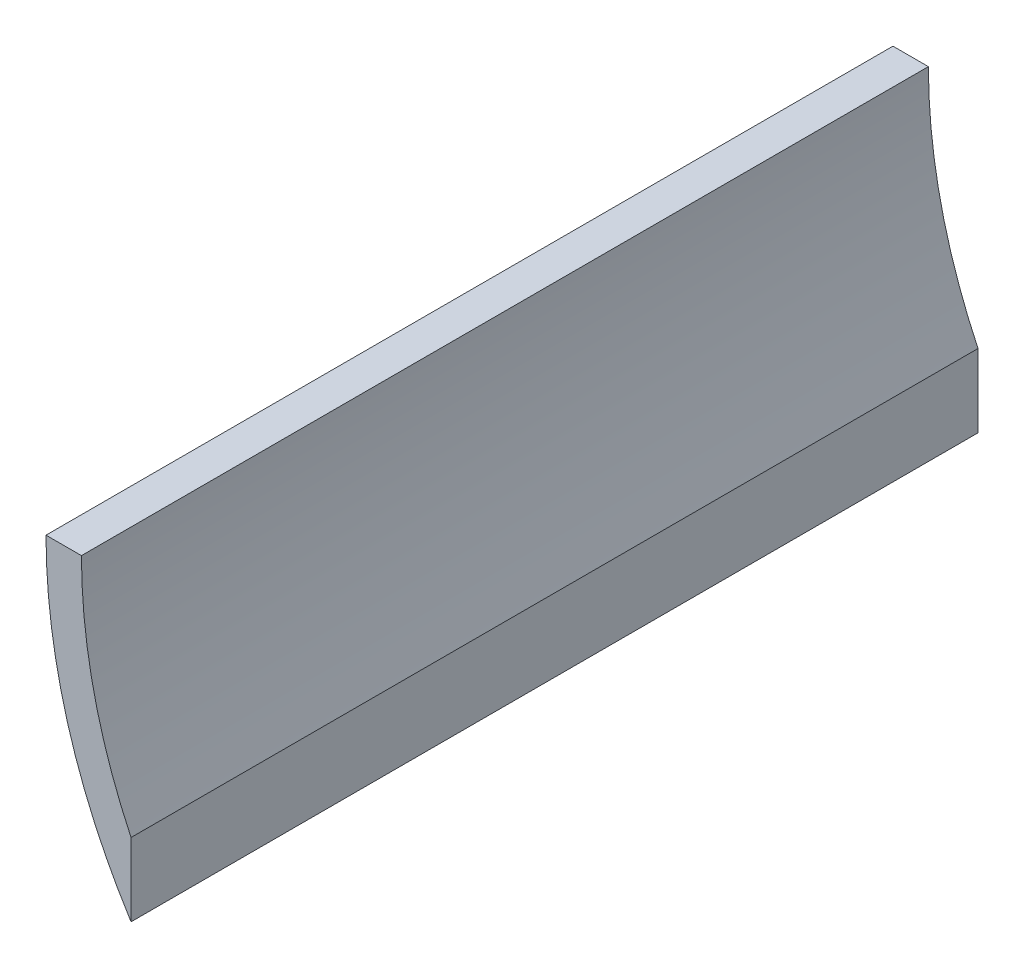
ISO-10303-21;
HEADER;
FILE_DESCRIPTION(('STEP AP214'),'2;1');
FILE_NAME('part.step','',(''),(''),'','','');
FILE_SCHEMA(('AUTOMOTIVE_DESIGN { 1 0 10303 214 1 1 1 1 }'));
ENDSEC;
DATA;
#1=APPLICATION_CONTEXT('core data for automotive mechanical design processes');
#2=APPLICATION_PROTOCOL_DEFINITION('international standard','automotive_design',2000,#1);
#3=PRODUCT_CONTEXT('',#1,'mechanical');
#4=PRODUCT('Part','Part','',(#3));
#5=PRODUCT_RELATED_PRODUCT_CATEGORY('part','',(#4));
#6=PRODUCT_DEFINITION_FORMATION('','',#4);
#7=PRODUCT_DEFINITION_CONTEXT('part definition',#1,'design');
#8=PRODUCT_DEFINITION('design','',#6,#7);
#9=PRODUCT_DEFINITION_SHAPE('','',#8);
#10=(LENGTH_UNIT() NAMED_UNIT(*) SI_UNIT(.MILLI.,.METRE.));
#11=(NAMED_UNIT(*) PLANE_ANGLE_UNIT() SI_UNIT($,.RADIAN.));
#12=(NAMED_UNIT(*) SI_UNIT($,.STERADIAN.) SOLID_ANGLE_UNIT());
#13=UNCERTAINTY_MEASURE_WITH_UNIT(LENGTH_MEASURE(1.E-05),#10,'distance_accuracy_value','');
#14=(GEOMETRIC_REPRESENTATION_CONTEXT(3) GLOBAL_UNCERTAINTY_ASSIGNED_CONTEXT((#13)) GLOBAL_UNIT_ASSIGNED_CONTEXT((#10,
#11,#12)) REPRESENTATION_CONTEXT('',''));
#15=CARTESIAN_POINT('',(0.,0.,0.));
#16=DIRECTION('',(0.,0.,1.));
#17=DIRECTION('',(1.,0.,0.));
#18=AXIS2_PLACEMENT_3D('',#15,#16,#17);
#19=CARTESIAN_POINT('',(47.7968749996477,14.7134363822845,324.920020949849));
#20=DIRECTION('',(0.,0.,-1.));
#21=DIRECTION('',(-1.,0.,0.));
#22=AXIS2_PLACEMENT_3D('',#19,#20,#21);
#23=CYLINDRICAL_SURFACE('',#22,153.796875000062);
#24=CARTESIAN_POINT('',(47.7968749996477,14.7134363822845,238.999999999999));
#25=DIRECTION('',(0.,0.,1.));
#26=DIRECTION('',(1.,0.,0.));
#27=AXIS2_PLACEMENT_3D('',#24,#25,#26);
#28=CIRCLE('',#27,153.796875000062);
#29=CARTESIAN_POINT('',(-106.000000000415,14.7134363822681,238.999999999999));
#30=VERTEX_POINT('',#29);
#31=CARTESIAN_POINT('',(-82.0000000004157,-67.7865636177321,238.999999999999));
#32=VERTEX_POINT('',#31);
#33=EDGE_CURVE('E11',#30,#32,#28,.T.);
#34=ORIENTED_EDGE('',*,*,#33,.F.);
#35=DIRECTION('',(0.,0.,-1.));
#36=VECTOR('',#35,1.);
#37=CARTESIAN_POINT('',(-106.000000000415,14.7134363822681,324.920020949849));
#38=LINE('',#37,#36);
#39=CARTESIAN_POINT('',(-106.000000000415,14.7134363822681,0.));
#40=VERTEX_POINT('',#39);
#41=EDGE_CURVE('E92',#30,#40,#38,.T.);
#42=ORIENTED_EDGE('',*,*,#41,.T.);
#43=CARTESIAN_POINT('',(47.7968749996477,14.7134363822845,0.));
#44=DIRECTION('',(0.,0.,1.));
#45=DIRECTION('',(1.,0.,0.));
#46=AXIS2_PLACEMENT_3D('',#43,#44,#45);
#47=CIRCLE('',#46,153.796875000062);
#48=CARTESIAN_POINT('',(-82.0000000004157,-67.7865636177321,0.));
#49=VERTEX_POINT('',#48);
#50=EDGE_CURVE('E83',#40,#49,#47,.T.);
#51=ORIENTED_EDGE('',*,*,#50,.T.);
#52=DIRECTION('',(0.,0.,-1.));
#53=VECTOR('',#52,1.);
#54=CARTESIAN_POINT('',(-82.0000000004157,-67.7865636177321,324.920020949849));
#55=LINE('',#54,#53);
#56=EDGE_CURVE('E75',#32,#49,#55,.T.);
#57=ORIENTED_EDGE('',*,*,#56,.F.);
#58=EDGE_LOOP('',(#34,#42,#51,#57));
#59=FACE_BOUND('',#58,.T.);
#60=ADVANCED_FACE('F36',(#59),#23,.T.);
#61=CARTESIAN_POINT('',(-81.9999999999974,-47.1760821172973,324.920020949849));
#62=DIRECTION('',(-1.,2.02970530149882E-11,0.));
#63=DIRECTION('',(-2.02970530149882E-11,-1.,0.));
#64=AXIS2_PLACEMENT_3D('',#61,#62,#63);
#65=PLANE('',#64);
#66=DIRECTION('',(2.02970530149882E-11,1.,0.));
#67=VECTOR('',#66,1.);
#68=CARTESIAN_POINT('',(-81.9999999999974,-47.1760821172973,238.999999999999));
#69=LINE('',#68,#67);
#70=CARTESIAN_POINT('',(-82.0000000004151,-47.1760821159443,238.999999999999));
#71=VERTEX_POINT('',#70);
#72=EDGE_CURVE('E54',#32,#71,#69,.T.);
#73=ORIENTED_EDGE('',*,*,#72,.F.);
#74=ORIENTED_EDGE('',*,*,#56,.T.);
#75=DIRECTION('',(2.02970530149882E-11,1.,0.));
#76=VECTOR('',#75,1.);
#77=CARTESIAN_POINT('',(-81.9999999999974,-47.1760821172973,0.));
#78=LINE('',#77,#76);
#79=CARTESIAN_POINT('',(-81.9999999999974,-47.1760821172973,0.));
#80=VERTEX_POINT('',#79);
#81=EDGE_CURVE('E78',#49,#80,#78,.T.);
#82=ORIENTED_EDGE('',*,*,#81,.T.);
#83=DIRECTION('',(0.,0.,-1.));
#84=VECTOR('',#83,1.);
#85=CARTESIAN_POINT('',(-81.9999999999974,-47.1760821172973,324.920020949849));
#86=LINE('',#85,#84);
#87=EDGE_CURVE('E72',#71,#80,#86,.T.);
#88=ORIENTED_EDGE('',*,*,#87,.F.);
#89=EDGE_LOOP('',(#73,#74,#82,#88));
#90=FACE_BOUND('',#89,.T.);
#91=ADVANCED_FACE('F77',(#90),#65,.F.);
#92=CARTESIAN_POINT('',(47.7968749996477,14.7134363822845,324.920020949849));
#93=DIRECTION('',(0.,0.,-1.));
#94=DIRECTION('',(-1.,0.,0.));
#95=AXIS2_PLACEMENT_3D('',#92,#93,#94);
#96=CYLINDRICAL_SURFACE('',#95,143.796874999857);
#97=CARTESIAN_POINT('',(47.7968749996477,14.7134363822845,238.999999999999));
#98=DIRECTION('',(0.,0.,1.));
#99=DIRECTION('',(1.,0.,0.));
#100=AXIS2_PLACEMENT_3D('',#97,#98,#99);
#101=CIRCLE('',#100,143.796874999857);
#102=CARTESIAN_POINT('',(-96.0000000002094,14.7134363822845,238.999999999999));
#103=VERTEX_POINT('',#102);
#104=EDGE_CURVE('E102',#71,#103,#101,.F.);
#105=ORIENTED_EDGE('',*,*,#104,.F.);
#106=ORIENTED_EDGE('',*,*,#87,.T.);
#107=CARTESIAN_POINT('',(47.7968749996477,14.7134363822845,0.));
#108=DIRECTION('',(0.,0.,-1.));
#109=DIRECTION('',(1.,0.,0.));
#110=AXIS2_PLACEMENT_3D('',#107,#108,#109);
#111=CIRCLE('',#110,143.796874999857);
#112=CARTESIAN_POINT('',(-96.0000000002094,14.7134363822845,0.));
#113=VERTEX_POINT('',#112);
#114=EDGE_CURVE('E89',#80,#113,#111,.T.);
#115=ORIENTED_EDGE('',*,*,#114,.T.);
#116=DIRECTION('',(0.,0.,-1.));
#117=VECTOR('',#116,1.);
#118=CARTESIAN_POINT('',(-96.0000000002094,14.7134363822845,324.920020949849));
#119=LINE('',#118,#117);
#120=EDGE_CURVE('E99',#103,#113,#119,.T.);
#121=ORIENTED_EDGE('',*,*,#120,.F.);
#122=EDGE_LOOP('',(#105,#106,#115,#121));
#123=FACE_BOUND('',#122,.T.);
#124=ADVANCED_FACE('F110',(#123),#96,.F.);
#125=CARTESIAN_POINT('',(-96.0000000000041,14.7134363822845,324.920020949849));
#126=DIRECTION('',(1.63809937829763E-12,-1.,0.));
#127=DIRECTION('',(1.,1.63809937829763E-12,0.));
#128=AXIS2_PLACEMENT_3D('',#125,#126,#127);
#129=PLANE('',#128);
#130=DIRECTION('',(-1.,-1.63809937829763E-12,0.));
#131=VECTOR('',#130,1.);
#132=CARTESIAN_POINT('',(-96.0000000000041,14.7134363822845,238.999999999999));
#133=LINE('',#132,#131);
#134=EDGE_CURVE('E40',#103,#30,#133,.T.);
#135=ORIENTED_EDGE('',*,*,#134,.F.);
#136=ORIENTED_EDGE('',*,*,#120,.T.);
#137=DIRECTION('',(-1.,-1.63809937829763E-12,0.));
#138=VECTOR('',#137,1.);
#139=CARTESIAN_POINT('',(-96.0000000000041,14.7134363822845,0.));
#140=LINE('',#139,#138);
#141=EDGE_CURVE('E100',#113,#40,#140,.T.);
#142=ORIENTED_EDGE('',*,*,#141,.T.);
#143=ORIENTED_EDGE('',*,*,#41,.F.);
#144=EDGE_LOOP('',(#135,#136,#142,#143));
#145=FACE_BOUND('',#144,.T.);
#146=ADVANCED_FACE('F108',(#145),#129,.F.);
#147=CARTESIAN_POINT('',(47.7968749996477,14.7134363822845,0.));
#148=DIRECTION('',(0.,0.,1.));
#149=DIRECTION('',(1.,0.,0.));
#150=AXIS2_PLACEMENT_3D('',#147,#148,#149);
#151=PLANE('',#150);
#152=ORIENTED_EDGE('',*,*,#50,.F.);
#153=ORIENTED_EDGE('',*,*,#141,.F.);
#154=ORIENTED_EDGE('',*,*,#114,.F.);
#155=ORIENTED_EDGE('',*,*,#81,.F.);
#156=EDGE_LOOP('',(#152,#153,#154,#155));
#157=FACE_BOUND('',#156,.T.);
#158=ADVANCED_FACE('F87',(#157),#151,.F.);
#159=CARTESIAN_POINT('',(-4.16032494896172E-10,-3.77974561371897E-12,238.999999999999));
#160=DIRECTION('',(0.,0.,1.));
#161=DIRECTION('',(1.,0.,0.));
#162=AXIS2_PLACEMENT_3D('',#159,#160,#161);
#163=PLANE('',#162);
#164=ORIENTED_EDGE('',*,*,#72,.T.);
#165=ORIENTED_EDGE('',*,*,#104,.T.);
#166=ORIENTED_EDGE('',*,*,#134,.T.);
#167=ORIENTED_EDGE('',*,*,#33,.T.);
#168=EDGE_LOOP('',(#164,#165,#166,#167));
#169=FACE_BOUND('',#168,.T.);
#170=ADVANCED_FACE('F38',(#169),#163,.T.);
#171=CLOSED_SHELL('',(#60,#91,#124,#146,#158,#170));
#172=MANIFOLD_SOLID_BREP('B2',#171);
#173=ADVANCED_BREP_SHAPE_REPRESENTATION('',(#18,#172),#14);
#174=SHAPE_DEFINITION_REPRESENTATION(#9,#173);
ENDSEC;
END-ISO-10303-21;
